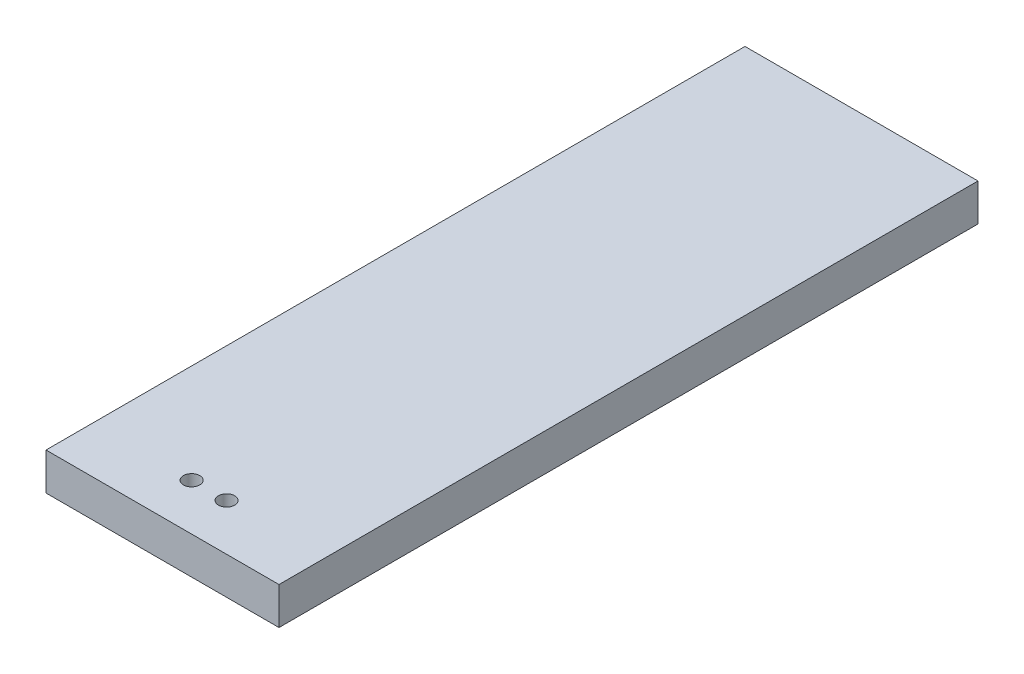
ISO-10303-21;
HEADER;
FILE_DESCRIPTION(('STEP AP214'),'2;1');
FILE_NAME('part.step','',(''),(''),'','','');
FILE_SCHEMA(('AUTOMOTIVE_DESIGN { 1 0 10303 214 1 1 1 1 }'));
ENDSEC;
DATA;
#1=APPLICATION_CONTEXT('core data for automotive mechanical design processes');
#2=APPLICATION_PROTOCOL_DEFINITION('international standard','automotive_design',2000,#1);
#3=PRODUCT_CONTEXT('',#1,'mechanical');
#4=PRODUCT('Part','Part','',(#3));
#5=PRODUCT_RELATED_PRODUCT_CATEGORY('part','',(#4));
#6=PRODUCT_DEFINITION_FORMATION('','',#4);
#7=PRODUCT_DEFINITION_CONTEXT('part definition',#1,'design');
#8=PRODUCT_DEFINITION('design','',#6,#7);
#9=PRODUCT_DEFINITION_SHAPE('','',#8);
#10=(LENGTH_UNIT() NAMED_UNIT(*) SI_UNIT(.MILLI.,.METRE.));
#11=(NAMED_UNIT(*) PLANE_ANGLE_UNIT() SI_UNIT($,.RADIAN.));
#12=(NAMED_UNIT(*) SI_UNIT($,.STERADIAN.) SOLID_ANGLE_UNIT());
#13=UNCERTAINTY_MEASURE_WITH_UNIT(LENGTH_MEASURE(1.E-05),#10,'distance_accuracy_value','');
#14=(GEOMETRIC_REPRESENTATION_CONTEXT(3) GLOBAL_UNCERTAINTY_ASSIGNED_CONTEXT((#13)) GLOBAL_UNIT_ASSIGNED_CONTEXT((#10,
#11,#12)) REPRESENTATION_CONTEXT('',''));
#15=CARTESIAN_POINT('',(0.,0.,0.));
#16=DIRECTION('',(0.,0.,1.));
#17=DIRECTION('',(1.,0.,0.));
#18=AXIS2_PLACEMENT_3D('',#15,#16,#17);
#19=CARTESIAN_POINT('',(0.,1.6,0.));
#20=DIRECTION('',(1.,0.,0.));
#21=DIRECTION('',(0.,0.,-1.));
#22=AXIS2_PLACEMENT_3D('',#19,#20,#21);
#23=PLANE('',#22);
#24=DIRECTION('',(0.,0.,1.));
#25=VECTOR('',#24,1.);
#26=CARTESIAN_POINT('',(0.,0.,0.));
#27=LINE('',#26,#25);
#28=CARTESIAN_POINT('',(0.,0.,-30.));
#29=VERTEX_POINT('',#28);
#30=CARTESIAN_POINT('',(0.,0.,0.));
#31=VERTEX_POINT('',#30);
#32=EDGE_CURVE('E104',#29,#31,#27,.T.);
#33=ORIENTED_EDGE('',*,*,#32,.T.);
#34=DIRECTION('',(0.,-1.,0.));
#35=VECTOR('',#34,1.);
#36=CARTESIAN_POINT('',(0.,1.6,0.));
#37=LINE('',#36,#35);
#38=CARTESIAN_POINT('',(0.,1.6,0.));
#39=VERTEX_POINT('',#38);
#40=EDGE_CURVE('E11',#39,#31,#37,.T.);
#41=ORIENTED_EDGE('',*,*,#40,.F.);
#42=DIRECTION('',(0.,0.,1.));
#43=VECTOR('',#42,1.);
#44=CARTESIAN_POINT('',(0.,1.6,0.));
#45=LINE('',#44,#43);
#46=CARTESIAN_POINT('',(0.,1.6,-30.));
#47=VERTEX_POINT('',#46);
#48=EDGE_CURVE('E92',#47,#39,#45,.T.);
#49=ORIENTED_EDGE('',*,*,#48,.F.);
#50=DIRECTION('',(0.,-1.,0.));
#51=VECTOR('',#50,1.);
#52=CARTESIAN_POINT('',(0.,1.6,-30.));
#53=LINE('',#52,#51);
#54=EDGE_CURVE('E100',#47,#29,#53,.T.);
#55=ORIENTED_EDGE('',*,*,#54,.T.);
#56=EDGE_LOOP('',(#33,#41,#49,#55));
#57=FACE_BOUND('',#56,.T.);
#58=ADVANCED_FACE('F41',(#57),#23,.F.);
#59=CARTESIAN_POINT('',(0.,1.6,0.));
#60=DIRECTION('',(0.,0.,-1.));
#61=DIRECTION('',(-1.,0.,0.));
#62=AXIS2_PLACEMENT_3D('',#59,#60,#61);
#63=PLANE('',#62);
#64=DIRECTION('',(1.,0.,0.));
#65=VECTOR('',#64,1.);
#66=CARTESIAN_POINT('',(0.,0.,0.));
#67=LINE('',#66,#65);
#68=CARTESIAN_POINT('',(10.,0.,0.));
#69=VERTEX_POINT('',#68);
#70=EDGE_CURVE('E96',#31,#69,#67,.T.);
#71=ORIENTED_EDGE('',*,*,#70,.T.);
#72=DIRECTION('',(0.,-1.,0.));
#73=VECTOR('',#72,1.);
#74=CARTESIAN_POINT('',(10.,1.6,0.));
#75=LINE('',#74,#73);
#76=CARTESIAN_POINT('',(10.,1.6,0.));
#77=VERTEX_POINT('',#76);
#78=EDGE_CURVE('E49',#77,#69,#75,.T.);
#79=ORIENTED_EDGE('',*,*,#78,.F.);
#80=DIRECTION('',(1.,0.,0.));
#81=VECTOR('',#80,1.);
#82=CARTESIAN_POINT('',(0.,1.6,0.));
#83=LINE('',#82,#81);
#84=EDGE_CURVE('E87',#39,#77,#83,.T.);
#85=ORIENTED_EDGE('',*,*,#84,.F.);
#86=ORIENTED_EDGE('',*,*,#40,.T.);
#87=EDGE_LOOP('',(#71,#79,#85,#86));
#88=FACE_BOUND('',#87,.T.);
#89=ADVANCED_FACE('F95',(#88),#63,.F.);
#90=CARTESIAN_POINT('',(10.,1.6,0.));
#91=DIRECTION('',(-1.,0.,0.));
#92=DIRECTION('',(0.,0.,1.));
#93=AXIS2_PLACEMENT_3D('',#90,#91,#92);
#94=PLANE('',#93);
#95=DIRECTION('',(0.,0.,-1.));
#96=VECTOR('',#95,1.);
#97=CARTESIAN_POINT('',(10.,0.,0.));
#98=LINE('',#97,#96);
#99=CARTESIAN_POINT('',(10.,0.,-30.));
#100=VERTEX_POINT('',#99);
#101=EDGE_CURVE('E74',#69,#100,#98,.T.);
#102=ORIENTED_EDGE('',*,*,#101,.T.);
#103=DIRECTION('',(0.,-1.,0.));
#104=VECTOR('',#103,1.);
#105=CARTESIAN_POINT('',(10.,1.6,-30.));
#106=LINE('',#105,#104);
#107=CARTESIAN_POINT('',(10.,1.6,-30.));
#108=VERTEX_POINT('',#107);
#109=EDGE_CURVE('E97',#108,#100,#106,.T.);
#110=ORIENTED_EDGE('',*,*,#109,.F.);
#111=DIRECTION('',(0.,0.,-1.));
#112=VECTOR('',#111,1.);
#113=CARTESIAN_POINT('',(10.,1.6,0.));
#114=LINE('',#113,#112);
#115=EDGE_CURVE('E90',#77,#108,#114,.T.);
#116=ORIENTED_EDGE('',*,*,#115,.F.);
#117=ORIENTED_EDGE('',*,*,#78,.T.);
#118=EDGE_LOOP('',(#102,#110,#116,#117));
#119=FACE_BOUND('',#118,.T.);
#120=ADVANCED_FACE('F98',(#119),#94,.F.);
#121=CARTESIAN_POINT('',(0.,1.6,-30.));
#122=DIRECTION('',(0.,0.,1.));
#123=DIRECTION('',(1.,0.,0.));
#124=AXIS2_PLACEMENT_3D('',#121,#122,#123);
#125=PLANE('',#124);
#126=DIRECTION('',(-1.,0.,0.));
#127=VECTOR('',#126,1.);
#128=CARTESIAN_POINT('',(0.,0.,-30.));
#129=LINE('',#128,#127);
#130=EDGE_CURVE('E80',#100,#29,#129,.T.);
#131=ORIENTED_EDGE('',*,*,#130,.T.);
#132=ORIENTED_EDGE('',*,*,#54,.F.);
#133=DIRECTION('',(-1.,0.,0.));
#134=VECTOR('',#133,1.);
#135=CARTESIAN_POINT('',(0.,1.6,-30.));
#136=LINE('',#135,#134);
#137=EDGE_CURVE('E57',#108,#47,#136,.T.);
#138=ORIENTED_EDGE('',*,*,#137,.F.);
#139=ORIENTED_EDGE('',*,*,#109,.T.);
#140=EDGE_LOOP('',(#131,#132,#138,#139));
#141=FACE_BOUND('',#140,.T.);
#142=ADVANCED_FACE('F112',(#141),#125,.F.);
#143=CARTESIAN_POINT('',(0.,1.6,0.));
#144=DIRECTION('',(0.,-1.,0.));
#145=DIRECTION('',(0.,0.,-1.));
#146=AXIS2_PLACEMENT_3D('',#143,#144,#145);
#147=PLANE('',#146);
#148=CARTESIAN_POINT('',(4.25000000000001,1.6,-2.));
#149=DIRECTION('',(0.,1.,0.));
#150=DIRECTION('',(0.,0.,1.));
#151=AXIS2_PLACEMENT_3D('',#148,#149,#150);
#152=CIRCLE('',#151,0.349999999999999);
#153=CARTESIAN_POINT('',(4.25000000000001,1.6,-1.65));
#154=VERTEX_POINT('',#153);
#155=EDGE_CURVE('E124',#154,#154,#152,.T.);
#156=ORIENTED_EDGE('',*,*,#155,.F.);
#157=EDGE_LOOP('',(#156));
#158=FACE_BOUND('',#157,.T.);
#159=CARTESIAN_POINT('',(5.75000000000002,1.6,-2.));
#160=DIRECTION('',(0.,1.,0.));
#161=DIRECTION('',(0.,0.,1.));
#162=AXIS2_PLACEMENT_3D('',#159,#160,#161);
#163=CIRCLE('',#162,0.349999999999999);
#164=CARTESIAN_POINT('',(5.75000000000002,1.6,-1.65));
#165=VERTEX_POINT('',#164);
#166=EDGE_CURVE('E121',#165,#165,#163,.T.);
#167=ORIENTED_EDGE('',*,*,#166,.F.);
#168=EDGE_LOOP('',(#167));
#169=FACE_BOUND('',#168,.T.);
#170=ORIENTED_EDGE('',*,*,#48,.T.);
#171=ORIENTED_EDGE('',*,*,#84,.T.);
#172=ORIENTED_EDGE('',*,*,#115,.T.);
#173=ORIENTED_EDGE('',*,*,#137,.T.);
#174=EDGE_LOOP('',(#170,#171,#172,#173));
#175=FACE_BOUND('',#174,.T.);
#176=ADVANCED_FACE('F88',(#158,#169,#175),#147,.F.);
#177=CARTESIAN_POINT('',(0.,0.,0.));
#178=DIRECTION('',(0.,-1.,0.));
#179=DIRECTION('',(0.,0.,-1.));
#180=AXIS2_PLACEMENT_3D('',#177,#178,#179);
#181=PLANE('',#180);
#182=CARTESIAN_POINT('',(4.25000000000001,0.,-2.));
#183=DIRECTION('',(0.,1.,0.));
#184=DIRECTION('',(0.,0.,1.));
#185=AXIS2_PLACEMENT_3D('',#182,#183,#184);
#186=CIRCLE('',#185,0.349999999999999);
#187=CARTESIAN_POINT('',(4.25000000000001,0.,-1.65));
#188=VERTEX_POINT('',#187);
#189=EDGE_CURVE('E107',#188,#188,#186,.T.);
#190=ORIENTED_EDGE('',*,*,#189,.T.);
#191=EDGE_LOOP('',(#190));
#192=FACE_BOUND('',#191,.T.);
#193=CARTESIAN_POINT('',(5.75000000000002,0.,-2.));
#194=DIRECTION('',(0.,1.,0.));
#195=DIRECTION('',(0.,0.,1.));
#196=AXIS2_PLACEMENT_3D('',#193,#194,#195);
#197=CIRCLE('',#196,0.349999999999999);
#198=CARTESIAN_POINT('',(5.75000000000002,0.,-1.65));
#199=VERTEX_POINT('',#198);
#200=EDGE_CURVE('E118',#199,#199,#197,.T.);
#201=ORIENTED_EDGE('',*,*,#200,.T.);
#202=EDGE_LOOP('',(#201));
#203=FACE_BOUND('',#202,.T.);
#204=ORIENTED_EDGE('',*,*,#32,.F.);
#205=ORIENTED_EDGE('',*,*,#130,.F.);
#206=ORIENTED_EDGE('',*,*,#101,.F.);
#207=ORIENTED_EDGE('',*,*,#70,.F.);
#208=EDGE_LOOP('',(#204,#205,#206,#207));
#209=FACE_BOUND('',#208,.T.);
#210=ADVANCED_FACE('F115',(#192,#203,#209),#181,.T.);
#211=CARTESIAN_POINT('',(5.75000000000002,0.,-2.));
#212=DIRECTION('',(0.,1.,0.));
#213=DIRECTION('',(0.,0.,1.));
#214=AXIS2_PLACEMENT_3D('',#211,#212,#213);
#215=CYLINDRICAL_SURFACE('',#214,0.349999999999999);
#216=ORIENTED_EDGE('',*,*,#200,.F.);
#217=EDGE_LOOP('',(#216));
#218=FACE_BOUND('',#217,.T.);
#219=ORIENTED_EDGE('',*,*,#166,.T.);
#220=EDGE_LOOP('',(#219));
#221=FACE_BOUND('',#220,.T.);
#222=ADVANCED_FACE('F135',(#218,#221),#215,.F.);
#223=CARTESIAN_POINT('',(4.25000000000001,0.,-2.));
#224=DIRECTION('',(0.,1.,0.));
#225=DIRECTION('',(0.,0.,1.));
#226=AXIS2_PLACEMENT_3D('',#223,#224,#225);
#227=CYLINDRICAL_SURFACE('',#226,0.349999999999999);
#228=ORIENTED_EDGE('',*,*,#189,.F.);
#229=EDGE_LOOP('',(#228));
#230=FACE_BOUND('',#229,.T.);
#231=ORIENTED_EDGE('',*,*,#155,.T.);
#232=EDGE_LOOP('',(#231));
#233=FACE_BOUND('',#232,.T.);
#234=ADVANCED_FACE('F132',(#230,#233),#227,.F.);
#235=CLOSED_SHELL('',(#58,#89,#120,#142,#176,#210,#222,#234));
#236=MANIFOLD_SOLID_BREP('B2',#235);
#237=ADVANCED_BREP_SHAPE_REPRESENTATION('',(#18,#236),#14);
#238=SHAPE_DEFINITION_REPRESENTATION(#9,#237);
ENDSEC;
END-ISO-10303-21;
